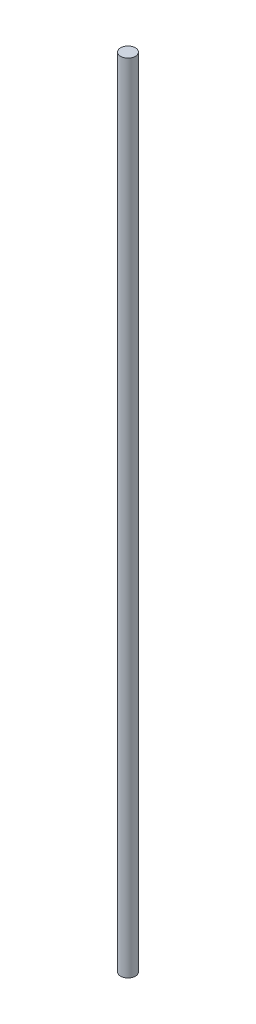
ISO-10303-21;
HEADER;
FILE_DESCRIPTION(('STEP AP214'),'2;1');
FILE_NAME('part.step','',(''),(''),'','','');
FILE_SCHEMA(('AUTOMOTIVE_DESIGN { 1 0 10303 214 1 1 1 1 }'));
ENDSEC;
DATA;
#1=APPLICATION_CONTEXT('core data for automotive mechanical design processes');
#2=APPLICATION_PROTOCOL_DEFINITION('international standard','automotive_design',2000,#1);
#3=PRODUCT_CONTEXT('',#1,'mechanical');
#4=PRODUCT('Part','Part','',(#3));
#5=PRODUCT_RELATED_PRODUCT_CATEGORY('part','',(#4));
#6=PRODUCT_DEFINITION_FORMATION('','',#4);
#7=PRODUCT_DEFINITION_CONTEXT('part definition',#1,'design');
#8=PRODUCT_DEFINITION('design','',#6,#7);
#9=PRODUCT_DEFINITION_SHAPE('','',#8);
#10=(LENGTH_UNIT() NAMED_UNIT(*) SI_UNIT(.MILLI.,.METRE.));
#11=(NAMED_UNIT(*) PLANE_ANGLE_UNIT() SI_UNIT($,.RADIAN.));
#12=(NAMED_UNIT(*) SI_UNIT($,.STERADIAN.) SOLID_ANGLE_UNIT());
#13=UNCERTAINTY_MEASURE_WITH_UNIT(LENGTH_MEASURE(1.E-05),#10,'distance_accuracy_value','');
#14=(GEOMETRIC_REPRESENTATION_CONTEXT(3) GLOBAL_UNCERTAINTY_ASSIGNED_CONTEXT((#13)) GLOBAL_UNIT_ASSIGNED_CONTEXT((#10,
#11,#12)) REPRESENTATION_CONTEXT('',''));
#15=CARTESIAN_POINT('',(0.,0.,0.));
#16=DIRECTION('',(0.,0.,1.));
#17=DIRECTION('',(1.,0.,0.));
#18=AXIS2_PLACEMENT_3D('',#15,#16,#17);
#19=CARTESIAN_POINT('',(0.,1708.15,0.));
#20=DIRECTION('',(0.,-1.,0.));
#21=DIRECTION('',(0.,0.,-1.));
#22=AXIS2_PLACEMENT_3D('',#19,#20,#21);
#23=CYLINDRICAL_SURFACE('',#22,15.875);
#24=CARTESIAN_POINT('',(0.,1708.15,0.));
#25=DIRECTION('',(0.,1.,0.));
#26=DIRECTION('',(0.,0.,1.));
#27=AXIS2_PLACEMENT_3D('',#24,#25,#26);
#28=CIRCLE('',#27,15.875);
#29=CARTESIAN_POINT('',(0.,1708.15,15.875));
#30=VERTEX_POINT('',#29);
#31=EDGE_CURVE('E10',#30,#30,#28,.T.);
#32=ORIENTED_EDGE('',*,*,#31,.F.);
#33=EDGE_LOOP('',(#32));
#34=FACE_BOUND('',#33,.T.);
#35=CARTESIAN_POINT('',(0.,0.,0.));
#36=DIRECTION('',(0.,1.,0.));
#37=DIRECTION('',(0.,0.,1.));
#38=AXIS2_PLACEMENT_3D('',#35,#36,#37);
#39=CIRCLE('',#38,15.875);
#40=CARTESIAN_POINT('',(0.,0.,15.875));
#41=VERTEX_POINT('',#40);
#42=EDGE_CURVE('E34',#41,#41,#39,.T.);
#43=ORIENTED_EDGE('',*,*,#42,.T.);
#44=EDGE_LOOP('',(#43));
#45=FACE_BOUND('',#44,.T.);
#46=ADVANCED_FACE('F31',(#34,#45),#23,.T.);
#47=CARTESIAN_POINT('',(0.,1708.15,0.));
#48=DIRECTION('',(0.,1.,0.));
#49=DIRECTION('',(0.,0.,1.));
#50=AXIS2_PLACEMENT_3D('',#47,#48,#49);
#51=PLANE('',#50);
#52=ORIENTED_EDGE('',*,*,#31,.T.);
#53=EDGE_LOOP('',(#52));
#54=FACE_BOUND('',#53,.T.);
#55=ADVANCED_FACE('F46',(#54),#51,.T.);
#56=CARTESIAN_POINT('',(0.,0.,0.));
#57=DIRECTION('',(0.,1.,0.));
#58=DIRECTION('',(0.,0.,1.));
#59=AXIS2_PLACEMENT_3D('',#56,#57,#58);
#60=PLANE('',#59);
#61=ORIENTED_EDGE('',*,*,#42,.F.);
#62=EDGE_LOOP('',(#61));
#63=FACE_BOUND('',#62,.T.);
#64=ADVANCED_FACE('F44',(#63),#60,.F.);
#65=CLOSED_SHELL('',(#46,#55,#64));
#66=MANIFOLD_SOLID_BREP('B2',#65);
#67=ADVANCED_BREP_SHAPE_REPRESENTATION('',(#18,#66),#14);
#68=SHAPE_DEFINITION_REPRESENTATION(#9,#67);
ENDSEC;
END-ISO-10303-21;
